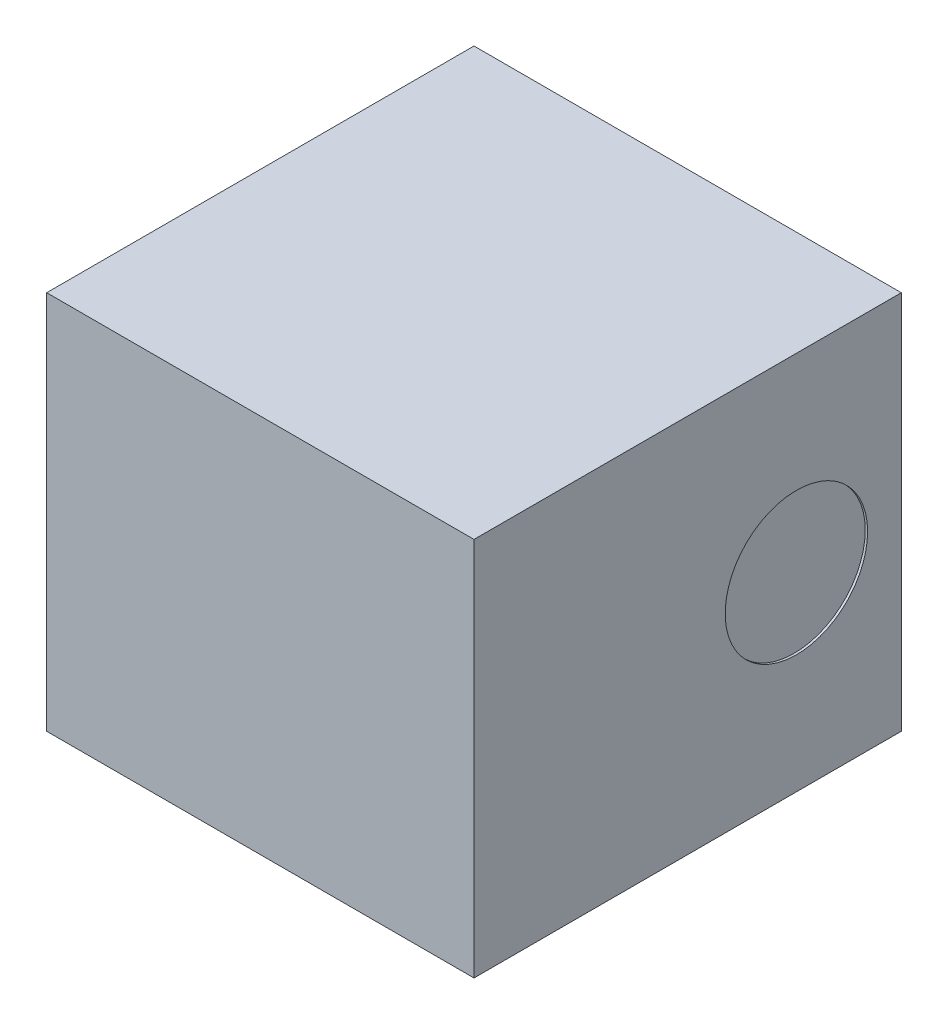
ISO-10303-21;
HEADER;
FILE_DESCRIPTION(('STEP AP214'),'2;1');
FILE_NAME('part.step','',(''),(''),'','','');
FILE_SCHEMA(('AUTOMOTIVE_DESIGN { 1 0 10303 214 1 1 1 1 }'));
ENDSEC;
DATA;
#1=APPLICATION_CONTEXT('core data for automotive mechanical design processes');
#2=APPLICATION_PROTOCOL_DEFINITION('international standard','automotive_design',2000,#1);
#3=PRODUCT_CONTEXT('',#1,'mechanical');
#4=PRODUCT('Part','Part','',(#3));
#5=PRODUCT_RELATED_PRODUCT_CATEGORY('part','',(#4));
#6=PRODUCT_DEFINITION_FORMATION('','',#4);
#7=PRODUCT_DEFINITION_CONTEXT('part definition',#1,'design');
#8=PRODUCT_DEFINITION('design','',#6,#7);
#9=PRODUCT_DEFINITION_SHAPE('','',#8);
#10=(LENGTH_UNIT() NAMED_UNIT(*) SI_UNIT(.MILLI.,.METRE.));
#11=(NAMED_UNIT(*) PLANE_ANGLE_UNIT() SI_UNIT($,.RADIAN.));
#12=(NAMED_UNIT(*) SI_UNIT($,.STERADIAN.) SOLID_ANGLE_UNIT());
#13=UNCERTAINTY_MEASURE_WITH_UNIT(LENGTH_MEASURE(1.E-05),#10,'distance_accuracy_value','');
#14=(GEOMETRIC_REPRESENTATION_CONTEXT(3) GLOBAL_UNCERTAINTY_ASSIGNED_CONTEXT((#13)) GLOBAL_UNIT_ASSIGNED_CONTEXT((#10,
#11,#12)) REPRESENTATION_CONTEXT('',''));
#15=CARTESIAN_POINT('',(0.,0.,0.));
#16=DIRECTION('',(0.,0.,1.));
#17=DIRECTION('',(1.,0.,0.));
#18=AXIS2_PLACEMENT_3D('',#15,#16,#17);
#19=CARTESIAN_POINT('',(-0.45,0.8,-0.449999999999999));
#20=DIRECTION('',(1.,0.,0.));
#21=DIRECTION('',(0.,0.,-1.));
#22=AXIS2_PLACEMENT_3D('',#19,#20,#21);
#23=PLANE('',#22);
#24=DIRECTION('',(0.,0.,1.));
#25=VECTOR('',#24,1.);
#26=CARTESIAN_POINT('',(-0.45,0.,-0.449999999999999));
#27=LINE('',#26,#25);
#28=CARTESIAN_POINT('',(-0.45,0.,-0.449999999999999));
#29=VERTEX_POINT('',#28);
#30=CARTESIAN_POINT('',(-0.449999999999999,0.,0.45));
#31=VERTEX_POINT('',#30);
#32=EDGE_CURVE('E98',#29,#31,#27,.T.);
#33=ORIENTED_EDGE('',*,*,#32,.T.);
#34=DIRECTION('',(0.,-1.,0.));
#35=VECTOR('',#34,1.);
#36=CARTESIAN_POINT('',(-0.449999999999999,0.8,0.45));
#37=LINE('',#36,#35);
#38=CARTESIAN_POINT('',(-0.449999999999999,0.8,0.45));
#39=VERTEX_POINT('',#38);
#40=EDGE_CURVE('E11',#39,#31,#37,.T.);
#41=ORIENTED_EDGE('',*,*,#40,.F.);
#42=DIRECTION('',(0.,0.,1.));
#43=VECTOR('',#42,1.);
#44=CARTESIAN_POINT('',(-0.45,0.8,-0.449999999999999));
#45=LINE('',#44,#43);
#46=CARTESIAN_POINT('',(-0.45,0.8,-0.449999999999999));
#47=VERTEX_POINT('',#46);
#48=EDGE_CURVE('E86',#47,#39,#45,.T.);
#49=ORIENTED_EDGE('',*,*,#48,.F.);
#50=DIRECTION('',(0.,-1.,0.));
#51=VECTOR('',#50,1.);
#52=CARTESIAN_POINT('',(-0.45,0.8,-0.449999999999999));
#53=LINE('',#52,#51);
#54=EDGE_CURVE('E94',#47,#29,#53,.T.);
#55=ORIENTED_EDGE('',*,*,#54,.T.);
#56=EDGE_LOOP('',(#33,#41,#49,#55));
#57=FACE_BOUND('',#56,.T.);
#58=ADVANCED_FACE('F35',(#57),#23,.F.);
#59=CARTESIAN_POINT('',(-0.449999999999999,0.8,0.45));
#60=DIRECTION('',(0.,0.,-1.));
#61=DIRECTION('',(-1.,0.,0.));
#62=AXIS2_PLACEMENT_3D('',#59,#60,#61);
#63=PLANE('',#62);
#64=DIRECTION('',(1.,0.,0.));
#65=VECTOR('',#64,1.);
#66=CARTESIAN_POINT('',(-0.449999999999999,0.,0.45));
#67=LINE('',#66,#65);
#68=CARTESIAN_POINT('',(0.45,0.,0.45));
#69=VERTEX_POINT('',#68);
#70=EDGE_CURVE('E90',#31,#69,#67,.T.);
#71=ORIENTED_EDGE('',*,*,#70,.T.);
#72=DIRECTION('',(0.,-1.,0.));
#73=VECTOR('',#72,1.);
#74=CARTESIAN_POINT('',(0.45,0.8,0.45));
#75=LINE('',#74,#73);
#76=CARTESIAN_POINT('',(0.45,0.8,0.45));
#77=VERTEX_POINT('',#76);
#78=EDGE_CURVE('E43',#77,#69,#75,.T.);
#79=ORIENTED_EDGE('',*,*,#78,.F.);
#80=DIRECTION('',(1.,0.,0.));
#81=VECTOR('',#80,1.);
#82=CARTESIAN_POINT('',(-0.449999999999999,0.8,0.45));
#83=LINE('',#82,#81);
#84=EDGE_CURVE('E81',#39,#77,#83,.T.);
#85=ORIENTED_EDGE('',*,*,#84,.F.);
#86=ORIENTED_EDGE('',*,*,#40,.T.);
#87=EDGE_LOOP('',(#71,#79,#85,#86));
#88=FACE_BOUND('',#87,.T.);
#89=ADVANCED_FACE('F89',(#88),#63,.F.);
#90=CARTESIAN_POINT('',(0.45,0.8,-0.45));
#91=DIRECTION('',(-1.,0.,0.));
#92=DIRECTION('',(0.,0.,1.));
#93=AXIS2_PLACEMENT_3D('',#90,#91,#92);
#94=PLANE('',#93);
#95=CARTESIAN_POINT('',(0.45,0.4,-0.229047371160854));
#96=DIRECTION('',(1.,0.,0.));
#97=DIRECTION('',(0.,0.,-1.));
#98=AXIS2_PLACEMENT_3D('',#95,#96,#97);
#99=CIRCLE('',#98,0.15);
#100=CARTESIAN_POINT('',(0.45,0.4,-0.379047371160854));
#101=VERTEX_POINT('',#100);
#102=EDGE_CURVE('E112',#101,#101,#99,.T.);
#103=ORIENTED_EDGE('',*,*,#102,.F.);
#104=EDGE_LOOP('',(#103));
#105=FACE_BOUND('',#104,.T.);
#106=DIRECTION('',(0.,0.,-1.));
#107=VECTOR('',#106,1.);
#108=CARTESIAN_POINT('',(0.45,0.,-0.45));
#109=LINE('',#108,#107);
#110=CARTESIAN_POINT('',(0.45,0.,-0.45));
#111=VERTEX_POINT('',#110);
#112=EDGE_CURVE('E68',#69,#111,#109,.T.);
#113=ORIENTED_EDGE('',*,*,#112,.T.);
#114=DIRECTION('',(0.,-1.,0.));
#115=VECTOR('',#114,1.);
#116=CARTESIAN_POINT('',(0.45,0.8,-0.45));
#117=LINE('',#116,#115);
#118=CARTESIAN_POINT('',(0.45,0.8,-0.45));
#119=VERTEX_POINT('',#118);
#120=EDGE_CURVE('E91',#119,#111,#117,.T.);
#121=ORIENTED_EDGE('',*,*,#120,.F.);
#122=DIRECTION('',(0.,0.,-1.));
#123=VECTOR('',#122,1.);
#124=CARTESIAN_POINT('',(0.45,0.8,-0.45));
#125=LINE('',#124,#123);
#126=EDGE_CURVE('E84',#77,#119,#125,.T.);
#127=ORIENTED_EDGE('',*,*,#126,.F.);
#128=ORIENTED_EDGE('',*,*,#78,.T.);
#129=EDGE_LOOP('',(#113,#121,#127,#128));
#130=FACE_BOUND('',#129,.T.);
#131=ADVANCED_FACE('F92',(#105,#130),#94,.F.);
#132=CARTESIAN_POINT('',(-0.45,0.8,-0.449999999999999));
#133=DIRECTION('',(0.,0.,1.));
#134=DIRECTION('',(1.,0.,0.));
#135=AXIS2_PLACEMENT_3D('',#132,#133,#134);
#136=PLANE('',#135);
#137=DIRECTION('',(-1.,0.,0.));
#138=VECTOR('',#137,1.);
#139=CARTESIAN_POINT('',(-0.45,0.,-0.449999999999999));
#140=LINE('',#139,#138);
#141=EDGE_CURVE('E74',#111,#29,#140,.T.);
#142=ORIENTED_EDGE('',*,*,#141,.T.);
#143=ORIENTED_EDGE('',*,*,#54,.F.);
#144=DIRECTION('',(-1.,0.,0.));
#145=VECTOR('',#144,1.);
#146=CARTESIAN_POINT('',(-0.45,0.8,-0.449999999999999));
#147=LINE('',#146,#145);
#148=EDGE_CURVE('E51',#119,#47,#147,.T.);
#149=ORIENTED_EDGE('',*,*,#148,.F.);
#150=ORIENTED_EDGE('',*,*,#120,.T.);
#151=EDGE_LOOP('',(#142,#143,#149,#150));
#152=FACE_BOUND('',#151,.T.);
#153=ADVANCED_FACE('F106',(#152),#136,.F.);
#154=CARTESIAN_POINT('',(0.,0.8,0.));
#155=DIRECTION('',(0.,1.,0.));
#156=DIRECTION('',(0.,0.,1.));
#157=AXIS2_PLACEMENT_3D('',#154,#155,#156);
#158=PLANE('',#157);
#159=ORIENTED_EDGE('',*,*,#48,.T.);
#160=ORIENTED_EDGE('',*,*,#84,.T.);
#161=ORIENTED_EDGE('',*,*,#126,.T.);
#162=ORIENTED_EDGE('',*,*,#148,.T.);
#163=EDGE_LOOP('',(#159,#160,#161,#162));
#164=FACE_BOUND('',#163,.T.);
#165=ADVANCED_FACE('F82',(#164),#158,.T.);
#166=CARTESIAN_POINT('',(0.,0.,0.));
#167=DIRECTION('',(0.,1.,0.));
#168=DIRECTION('',(0.,0.,1.));
#169=AXIS2_PLACEMENT_3D('',#166,#167,#168);
#170=PLANE('',#169);
#171=ORIENTED_EDGE('',*,*,#32,.F.);
#172=ORIENTED_EDGE('',*,*,#141,.F.);
#173=ORIENTED_EDGE('',*,*,#112,.F.);
#174=ORIENTED_EDGE('',*,*,#70,.F.);
#175=EDGE_LOOP('',(#171,#172,#173,#174));
#176=FACE_BOUND('',#175,.T.);
#177=ADVANCED_FACE('F109',(#176),#170,.F.);
#178=CARTESIAN_POINT('',(0.445,0.4,-0.229047371160854));
#179=DIRECTION('',(1.,0.,0.));
#180=DIRECTION('',(0.,0.,-1.));
#181=AXIS2_PLACEMENT_3D('',#178,#179,#180);
#182=CYLINDRICAL_SURFACE('',#181,0.15);
#183=CARTESIAN_POINT('',(0.445,0.4,-0.229047371160854));
#184=DIRECTION('',(1.,0.,0.));
#185=DIRECTION('',(0.,0.,-1.));
#186=AXIS2_PLACEMENT_3D('',#183,#184,#185);
#187=CIRCLE('',#186,0.15);
#188=CARTESIAN_POINT('',(0.445,0.4,-0.379047371160854));
#189=VERTEX_POINT('',#188);
#190=EDGE_CURVE('E101',#189,#189,#187,.T.);
#191=ORIENTED_EDGE('',*,*,#190,.F.);
#192=EDGE_LOOP('',(#191));
#193=FACE_BOUND('',#192,.T.);
#194=ORIENTED_EDGE('',*,*,#102,.T.);
#195=EDGE_LOOP('',(#194));
#196=FACE_BOUND('',#195,.T.);
#197=ADVANCED_FACE('F120',(#193,#196),#182,.F.);
#198=CARTESIAN_POINT('',(0.445,0.4,-0.229047371160854));
#199=DIRECTION('',(1.,0.,0.));
#200=DIRECTION('',(0.,0.,-1.));
#201=AXIS2_PLACEMENT_3D('',#198,#199,#200);
#202=PLANE('',#201);
#203=ORIENTED_EDGE('',*,*,#190,.T.);
#204=EDGE_LOOP('',(#203));
#205=FACE_BOUND('',#204,.T.);
#206=ADVANCED_FACE('F118',(#205),#202,.T.);
#207=CLOSED_SHELL('',(#58,#89,#131,#153,#165,#177,#197,#206));
#208=MANIFOLD_SOLID_BREP('B2',#207);
#209=ADVANCED_BREP_SHAPE_REPRESENTATION('',(#18,#208),#14);
#210=SHAPE_DEFINITION_REPRESENTATION(#9,#209);
ENDSEC;
END-ISO-10303-21;
